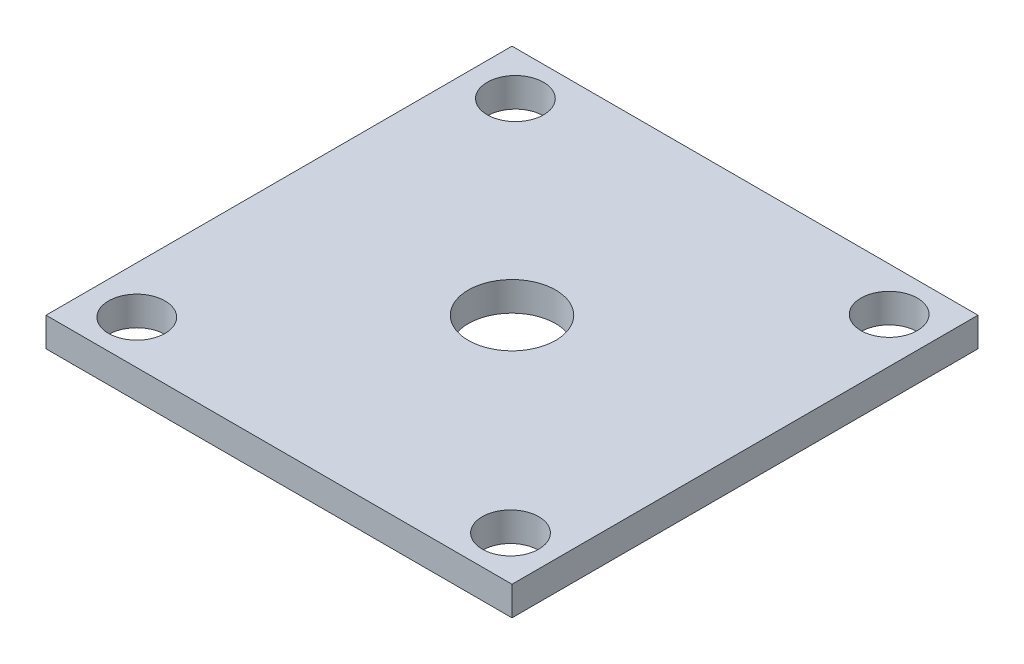
ISO-10303-21;
HEADER;
FILE_DESCRIPTION(('STEP AP214'),'2;1');
FILE_NAME('part.step','',(''),(''),'','','');
FILE_SCHEMA(('AUTOMOTIVE_DESIGN { 1 0 10303 214 1 1 1 1 }'));
ENDSEC;
DATA;
#1=APPLICATION_CONTEXT('core data for automotive mechanical design processes');
#2=APPLICATION_PROTOCOL_DEFINITION('international standard','automotive_design',2000,#1);
#3=PRODUCT_CONTEXT('',#1,'mechanical');
#4=PRODUCT('Part','Part','',(#3));
#5=PRODUCT_RELATED_PRODUCT_CATEGORY('part','',(#4));
#6=PRODUCT_DEFINITION_FORMATION('','',#4);
#7=PRODUCT_DEFINITION_CONTEXT('part definition',#1,'design');
#8=PRODUCT_DEFINITION('design','',#6,#7);
#9=PRODUCT_DEFINITION_SHAPE('','',#8);
#10=(LENGTH_UNIT() NAMED_UNIT(*) SI_UNIT(.MILLI.,.METRE.));
#11=(NAMED_UNIT(*) PLANE_ANGLE_UNIT() SI_UNIT($,.RADIAN.));
#12=(NAMED_UNIT(*) SI_UNIT($,.STERADIAN.) SOLID_ANGLE_UNIT());
#13=UNCERTAINTY_MEASURE_WITH_UNIT(LENGTH_MEASURE(1.E-05),#10,'distance_accuracy_value','');
#14=(GEOMETRIC_REPRESENTATION_CONTEXT(3) GLOBAL_UNCERTAINTY_ASSIGNED_CONTEXT((#13)) GLOBAL_UNIT_ASSIGNED_CONTEXT((#10,
#11,#12)) REPRESENTATION_CONTEXT('',''));
#15=CARTESIAN_POINT('',(0.,0.,0.));
#16=DIRECTION('',(0.,0.,1.));
#17=DIRECTION('',(1.,0.,0.));
#18=AXIS2_PLACEMENT_3D('',#15,#16,#17);
#19=CARTESIAN_POINT('',(0.,6.35,0.));
#20=DIRECTION('',(1.,0.,0.));
#21=DIRECTION('',(0.,0.,-1.));
#22=AXIS2_PLACEMENT_3D('',#19,#20,#21);
#23=PLANE('',#22);
#24=DIRECTION('',(0.,0.,1.));
#25=VECTOR('',#24,1.);
#26=CARTESIAN_POINT('',(0.,0.,0.));
#27=LINE('',#26,#25);
#28=CARTESIAN_POINT('',(0.,0.,-101.6));
#29=VERTEX_POINT('',#28);
#30=CARTESIAN_POINT('',(0.,0.,0.));
#31=VERTEX_POINT('',#30);
#32=EDGE_CURVE('E102',#29,#31,#27,.T.);
#33=ORIENTED_EDGE('',*,*,#32,.T.);
#34=DIRECTION('',(0.,-1.,0.));
#35=VECTOR('',#34,1.);
#36=CARTESIAN_POINT('',(0.,6.35,0.));
#37=LINE('',#36,#35);
#38=CARTESIAN_POINT('',(0.,6.35,0.));
#39=VERTEX_POINT('',#38);
#40=EDGE_CURVE('E11',#39,#31,#37,.T.);
#41=ORIENTED_EDGE('',*,*,#40,.F.);
#42=DIRECTION('',(0.,0.,1.));
#43=VECTOR('',#42,1.);
#44=CARTESIAN_POINT('',(0.,6.35,0.));
#45=LINE('',#44,#43);
#46=CARTESIAN_POINT('',(0.,6.35,-101.6));
#47=VERTEX_POINT('',#46);
#48=EDGE_CURVE('E90',#47,#39,#45,.T.);
#49=ORIENTED_EDGE('',*,*,#48,.F.);
#50=DIRECTION('',(0.,-1.,0.));
#51=VECTOR('',#50,1.);
#52=CARTESIAN_POINT('',(0.,6.35,-101.6));
#53=LINE('',#52,#51);
#54=EDGE_CURVE('E98',#47,#29,#53,.T.);
#55=ORIENTED_EDGE('',*,*,#54,.T.);
#56=EDGE_LOOP('',(#33,#41,#49,#55));
#57=FACE_BOUND('',#56,.T.);
#58=ADVANCED_FACE('F39',(#57),#23,.F.);
#59=CARTESIAN_POINT('',(0.,6.35,0.));
#60=DIRECTION('',(0.,0.,-1.));
#61=DIRECTION('',(-1.,0.,0.));
#62=AXIS2_PLACEMENT_3D('',#59,#60,#61);
#63=PLANE('',#62);
#64=DIRECTION('',(1.,0.,0.));
#65=VECTOR('',#64,1.);
#66=CARTESIAN_POINT('',(0.,0.,0.));
#67=LINE('',#66,#65);
#68=CARTESIAN_POINT('',(101.6,0.,0.));
#69=VERTEX_POINT('',#68);
#70=EDGE_CURVE('E94',#31,#69,#67,.T.);
#71=ORIENTED_EDGE('',*,*,#70,.T.);
#72=DIRECTION('',(0.,-1.,0.));
#73=VECTOR('',#72,1.);
#74=CARTESIAN_POINT('',(101.6,6.35,0.));
#75=LINE('',#74,#73);
#76=CARTESIAN_POINT('',(101.6,6.35,0.));
#77=VERTEX_POINT('',#76);
#78=EDGE_CURVE('E47',#77,#69,#75,.T.);
#79=ORIENTED_EDGE('',*,*,#78,.F.);
#80=DIRECTION('',(1.,0.,0.));
#81=VECTOR('',#80,1.);
#82=CARTESIAN_POINT('',(0.,6.35,0.));
#83=LINE('',#82,#81);
#84=EDGE_CURVE('E85',#39,#77,#83,.T.);
#85=ORIENTED_EDGE('',*,*,#84,.F.);
#86=ORIENTED_EDGE('',*,*,#40,.T.);
#87=EDGE_LOOP('',(#71,#79,#85,#86));
#88=FACE_BOUND('',#87,.T.);
#89=ADVANCED_FACE('F93',(#88),#63,.F.);
#90=CARTESIAN_POINT('',(101.6,6.35,0.));
#91=DIRECTION('',(-1.,0.,0.));
#92=DIRECTION('',(0.,0.,1.));
#93=AXIS2_PLACEMENT_3D('',#90,#91,#92);
#94=PLANE('',#93);
#95=DIRECTION('',(0.,0.,-1.));
#96=VECTOR('',#95,1.);
#97=CARTESIAN_POINT('',(101.6,0.,0.));
#98=LINE('',#97,#96);
#99=CARTESIAN_POINT('',(101.6,0.,-101.6));
#100=VERTEX_POINT('',#99);
#101=EDGE_CURVE('E72',#69,#100,#98,.T.);
#102=ORIENTED_EDGE('',*,*,#101,.T.);
#103=DIRECTION('',(0.,-1.,0.));
#104=VECTOR('',#103,1.);
#105=CARTESIAN_POINT('',(101.6,6.35,-101.6));
#106=LINE('',#105,#104);
#107=CARTESIAN_POINT('',(101.6,6.35,-101.6));
#108=VERTEX_POINT('',#107);
#109=EDGE_CURVE('E95',#108,#100,#106,.T.);
#110=ORIENTED_EDGE('',*,*,#109,.F.);
#111=DIRECTION('',(0.,0.,-1.));
#112=VECTOR('',#111,1.);
#113=CARTESIAN_POINT('',(101.6,6.35,0.));
#114=LINE('',#113,#112);
#115=EDGE_CURVE('E88',#77,#108,#114,.T.);
#116=ORIENTED_EDGE('',*,*,#115,.F.);
#117=ORIENTED_EDGE('',*,*,#78,.T.);
#118=EDGE_LOOP('',(#102,#110,#116,#117));
#119=FACE_BOUND('',#118,.T.);
#120=ADVANCED_FACE('F96',(#119),#94,.F.);
#121=CARTESIAN_POINT('',(0.,6.35,-101.6));
#122=DIRECTION('',(0.,0.,1.));
#123=DIRECTION('',(1.,0.,0.));
#124=AXIS2_PLACEMENT_3D('',#121,#122,#123);
#125=PLANE('',#124);
#126=DIRECTION('',(-1.,0.,0.));
#127=VECTOR('',#126,1.);
#128=CARTESIAN_POINT('',(0.,0.,-101.6));
#129=LINE('',#128,#127);
#130=EDGE_CURVE('E78',#100,#29,#129,.T.);
#131=ORIENTED_EDGE('',*,*,#130,.T.);
#132=ORIENTED_EDGE('',*,*,#54,.F.);
#133=DIRECTION('',(-1.,0.,0.));
#134=VECTOR('',#133,1.);
#135=CARTESIAN_POINT('',(0.,6.35,-101.6));
#136=LINE('',#135,#134);
#137=EDGE_CURVE('E55',#108,#47,#136,.T.);
#138=ORIENTED_EDGE('',*,*,#137,.F.);
#139=ORIENTED_EDGE('',*,*,#109,.T.);
#140=EDGE_LOOP('',(#131,#132,#138,#139));
#141=FACE_BOUND('',#140,.T.);
#142=ADVANCED_FACE('F110',(#141),#125,.F.);
#143=CARTESIAN_POINT('',(0.,6.35,0.));
#144=DIRECTION('',(0.,-1.,0.));
#145=DIRECTION('',(0.,0.,-1.));
#146=AXIS2_PLACEMENT_3D('',#143,#144,#145);
#147=PLANE('',#146);
#148=CARTESIAN_POINT('',(50.8,6.35,-50.8));
#149=DIRECTION('',(0.,1.,0.));
#150=DIRECTION('',(0.,0.,1.));
#151=AXIS2_PLACEMENT_3D('',#148,#149,#150);
#152=CIRCLE('',#151,9.525);
#153=CARTESIAN_POINT('',(50.8,6.35,-41.275));
#154=VERTEX_POINT('',#153);
#155=EDGE_CURVE('E142',#154,#154,#152,.T.);
#156=ORIENTED_EDGE('',*,*,#155,.F.);
#157=EDGE_LOOP('',(#156));
#158=FACE_BOUND('',#157,.T.);
#159=CARTESIAN_POINT('',(10.2661479921988,6.35,-92.075));
#160=DIRECTION('',(0.,1.,0.));
#161=DIRECTION('',(0.,0.,1.));
#162=AXIS2_PLACEMENT_3D('',#159,#160,#161);
#163=CIRCLE('',#162,6.15188);
#164=CARTESIAN_POINT('',(10.2661479921988,6.35,-85.92312));
#165=VERTEX_POINT('',#164);
#166=EDGE_CURVE('E136',#165,#165,#163,.T.);
#167=ORIENTED_EDGE('',*,*,#166,.F.);
#168=EDGE_LOOP('',(#167));
#169=FACE_BOUND('',#168,.T.);
#170=CARTESIAN_POINT('',(91.7517267707683,6.35,-9.525));
#171=DIRECTION('',(0.,1.,0.));
#172=DIRECTION('',(0.,0.,1.));
#173=AXIS2_PLACEMENT_3D('',#170,#171,#172);
#174=CIRCLE('',#173,6.15188);
#175=CARTESIAN_POINT('',(91.7517267707683,6.35,-3.37312));
#176=VERTEX_POINT('',#175);
#177=EDGE_CURVE('E130',#176,#176,#174,.T.);
#178=ORIENTED_EDGE('',*,*,#177,.F.);
#179=EDGE_LOOP('',(#178));
#180=FACE_BOUND('',#179,.T.);
#181=CARTESIAN_POINT('',(91.7517267707683,6.35,-92.075));
#182=DIRECTION('',(0.,1.,0.));
#183=DIRECTION('',(0.,0.,1.));
#184=AXIS2_PLACEMENT_3D('',#181,#182,#183);
#185=CIRCLE('',#184,6.15188);
#186=CARTESIAN_POINT('',(91.7517267707683,6.35,-85.92312));
#187=VERTEX_POINT('',#186);
#188=EDGE_CURVE('E124',#187,#187,#185,.T.);
#189=ORIENTED_EDGE('',*,*,#188,.F.);
#190=EDGE_LOOP('',(#189));
#191=FACE_BOUND('',#190,.T.);
#192=CARTESIAN_POINT('',(10.2661479921988,6.35,-9.525));
#193=DIRECTION('',(0.,1.,0.));
#194=DIRECTION('',(0.,0.,1.));
#195=AXIS2_PLACEMENT_3D('',#192,#193,#194);
#196=CIRCLE('',#195,6.15188);
#197=CARTESIAN_POINT('',(10.2661479921988,6.35,-3.37312));
#198=VERTEX_POINT('',#197);
#199=EDGE_CURVE('E118',#198,#198,#196,.T.);
#200=ORIENTED_EDGE('',*,*,#199,.F.);
#201=EDGE_LOOP('',(#200));
#202=FACE_BOUND('',#201,.T.);
#203=ORIENTED_EDGE('',*,*,#48,.T.);
#204=ORIENTED_EDGE('',*,*,#84,.T.);
#205=ORIENTED_EDGE('',*,*,#115,.T.);
#206=ORIENTED_EDGE('',*,*,#137,.T.);
#207=EDGE_LOOP('',(#203,#204,#205,#206));
#208=FACE_BOUND('',#207,.T.);
#209=ADVANCED_FACE('F86',(#158,#169,#180,#191,#202,#208),#147,.F.);
#210=CARTESIAN_POINT('',(0.,0.,0.));
#211=DIRECTION('',(0.,-1.,0.));
#212=DIRECTION('',(0.,0.,-1.));
#213=AXIS2_PLACEMENT_3D('',#210,#211,#212);
#214=PLANE('',#213);
#215=CARTESIAN_POINT('',(50.8,0.,-50.8));
#216=DIRECTION('',(0.,1.,0.));
#217=DIRECTION('',(0.,0.,1.));
#218=AXIS2_PLACEMENT_3D('',#215,#216,#217);
#219=CIRCLE('',#218,9.525);
#220=CARTESIAN_POINT('',(50.8,0.,-41.275));
#221=VERTEX_POINT('',#220);
#222=EDGE_CURVE('E139',#221,#221,#219,.T.);
#223=ORIENTED_EDGE('',*,*,#222,.T.);
#224=EDGE_LOOP('',(#223));
#225=FACE_BOUND('',#224,.T.);
#226=CARTESIAN_POINT('',(10.2661479921988,0.,-92.075));
#227=DIRECTION('',(0.,1.,0.));
#228=DIRECTION('',(0.,0.,1.));
#229=AXIS2_PLACEMENT_3D('',#226,#227,#228);
#230=CIRCLE('',#229,6.15188);
#231=CARTESIAN_POINT('',(10.2661479921988,0.,-85.92312));
#232=VERTEX_POINT('',#231);
#233=EDGE_CURVE('E133',#232,#232,#230,.T.);
#234=ORIENTED_EDGE('',*,*,#233,.T.);
#235=EDGE_LOOP('',(#234));
#236=FACE_BOUND('',#235,.T.);
#237=CARTESIAN_POINT('',(91.7517267707683,0.,-9.525));
#238=DIRECTION('',(0.,1.,0.));
#239=DIRECTION('',(0.,0.,1.));
#240=AXIS2_PLACEMENT_3D('',#237,#238,#239);
#241=CIRCLE('',#240,6.15188);
#242=CARTESIAN_POINT('',(91.7517267707683,0.,-3.37312));
#243=VERTEX_POINT('',#242);
#244=EDGE_CURVE('E127',#243,#243,#241,.T.);
#245=ORIENTED_EDGE('',*,*,#244,.T.);
#246=EDGE_LOOP('',(#245));
#247=FACE_BOUND('',#246,.T.);
#248=CARTESIAN_POINT('',(91.7517267707683,0.,-92.075));
#249=DIRECTION('',(0.,1.,0.));
#250=DIRECTION('',(0.,0.,1.));
#251=AXIS2_PLACEMENT_3D('',#248,#249,#250);
#252=CIRCLE('',#251,6.15188);
#253=CARTESIAN_POINT('',(91.7517267707683,0.,-85.92312));
#254=VERTEX_POINT('',#253);
#255=EDGE_CURVE('E121',#254,#254,#252,.T.);
#256=ORIENTED_EDGE('',*,*,#255,.T.);
#257=EDGE_LOOP('',(#256));
#258=FACE_BOUND('',#257,.T.);
#259=CARTESIAN_POINT('',(10.2661479921988,0.,-9.525));
#260=DIRECTION('',(0.,1.,0.));
#261=DIRECTION('',(0.,0.,1.));
#262=AXIS2_PLACEMENT_3D('',#259,#260,#261);
#263=CIRCLE('',#262,6.15188);
#264=CARTESIAN_POINT('',(10.2661479921988,0.,-3.37312));
#265=VERTEX_POINT('',#264);
#266=EDGE_CURVE('E105',#265,#265,#263,.T.);
#267=ORIENTED_EDGE('',*,*,#266,.T.);
#268=EDGE_LOOP('',(#267));
#269=FACE_BOUND('',#268,.T.);
#270=ORIENTED_EDGE('',*,*,#32,.F.);
#271=ORIENTED_EDGE('',*,*,#130,.F.);
#272=ORIENTED_EDGE('',*,*,#101,.F.);
#273=ORIENTED_EDGE('',*,*,#70,.F.);
#274=EDGE_LOOP('',(#270,#271,#272,#273));
#275=FACE_BOUND('',#274,.T.);
#276=ADVANCED_FACE('F113',(#225,#236,#247,#258,#269,#275),#214,.T.);
#277=CARTESIAN_POINT('',(10.2661479921988,6.35,-9.525));
#278=DIRECTION('',(0.,1.,0.));
#279=DIRECTION('',(0.,0.,1.));
#280=AXIS2_PLACEMENT_3D('',#277,#278,#279);
#281=CYLINDRICAL_SURFACE('',#280,6.15188);
#282=ORIENTED_EDGE('',*,*,#266,.F.);
#283=EDGE_LOOP('',(#282));
#284=FACE_BOUND('',#283,.T.);
#285=ORIENTED_EDGE('',*,*,#199,.T.);
#286=EDGE_LOOP('',(#285));
#287=FACE_BOUND('',#286,.T.);
#288=ADVANCED_FACE('F159',(#284,#287),#281,.F.);
#289=CARTESIAN_POINT('',(91.7517267707683,6.35,-92.075));
#290=DIRECTION('',(0.,1.,0.));
#291=DIRECTION('',(0.,0.,1.));
#292=AXIS2_PLACEMENT_3D('',#289,#290,#291);
#293=CYLINDRICAL_SURFACE('',#292,6.15188);
#294=ORIENTED_EDGE('',*,*,#255,.F.);
#295=EDGE_LOOP('',(#294));
#296=FACE_BOUND('',#295,.T.);
#297=ORIENTED_EDGE('',*,*,#188,.T.);
#298=EDGE_LOOP('',(#297));
#299=FACE_BOUND('',#298,.T.);
#300=ADVANCED_FACE('F161',(#296,#299),#293,.F.);
#301=CARTESIAN_POINT('',(91.7517267707683,6.35,-9.525));
#302=DIRECTION('',(0.,1.,0.));
#303=DIRECTION('',(0.,0.,1.));
#304=AXIS2_PLACEMENT_3D('',#301,#302,#303);
#305=CYLINDRICAL_SURFACE('',#304,6.15188);
#306=ORIENTED_EDGE('',*,*,#244,.F.);
#307=EDGE_LOOP('',(#306));
#308=FACE_BOUND('',#307,.T.);
#309=ORIENTED_EDGE('',*,*,#177,.T.);
#310=EDGE_LOOP('',(#309));
#311=FACE_BOUND('',#310,.T.);
#312=ADVANCED_FACE('F168',(#308,#311),#305,.F.);
#313=CARTESIAN_POINT('',(10.2661479921988,6.35,-92.075));
#314=DIRECTION('',(0.,1.,0.));
#315=DIRECTION('',(0.,0.,1.));
#316=AXIS2_PLACEMENT_3D('',#313,#314,#315);
#317=CYLINDRICAL_SURFACE('',#316,6.15188);
#318=ORIENTED_EDGE('',*,*,#233,.F.);
#319=EDGE_LOOP('',(#318));
#320=FACE_BOUND('',#319,.T.);
#321=ORIENTED_EDGE('',*,*,#166,.T.);
#322=EDGE_LOOP('',(#321));
#323=FACE_BOUND('',#322,.T.);
#324=ADVANCED_FACE('F208',(#320,#323),#317,.F.);
#325=CARTESIAN_POINT('',(50.8,6.35,-50.8));
#326=DIRECTION('',(0.,1.,0.));
#327=DIRECTION('',(0.,0.,1.));
#328=AXIS2_PLACEMENT_3D('',#325,#326,#327);
#329=CYLINDRICAL_SURFACE('',#328,9.525);
#330=ORIENTED_EDGE('',*,*,#222,.F.);
#331=EDGE_LOOP('',(#330));
#332=FACE_BOUND('',#331,.T.);
#333=ORIENTED_EDGE('',*,*,#155,.T.);
#334=EDGE_LOOP('',(#333));
#335=FACE_BOUND('',#334,.T.);
#336=ADVANCED_FACE('F146',(#332,#335),#329,.F.);
#337=CLOSED_SHELL('',(#58,#89,#120,#142,#209,#276,#288,#300,#312,#324,#336));
#338=MANIFOLD_SOLID_BREP('B2',#337);
#339=ADVANCED_BREP_SHAPE_REPRESENTATION('',(#18,#338),#14);
#340=SHAPE_DEFINITION_REPRESENTATION(#9,#339);
ENDSEC;
END-ISO-10303-21;
